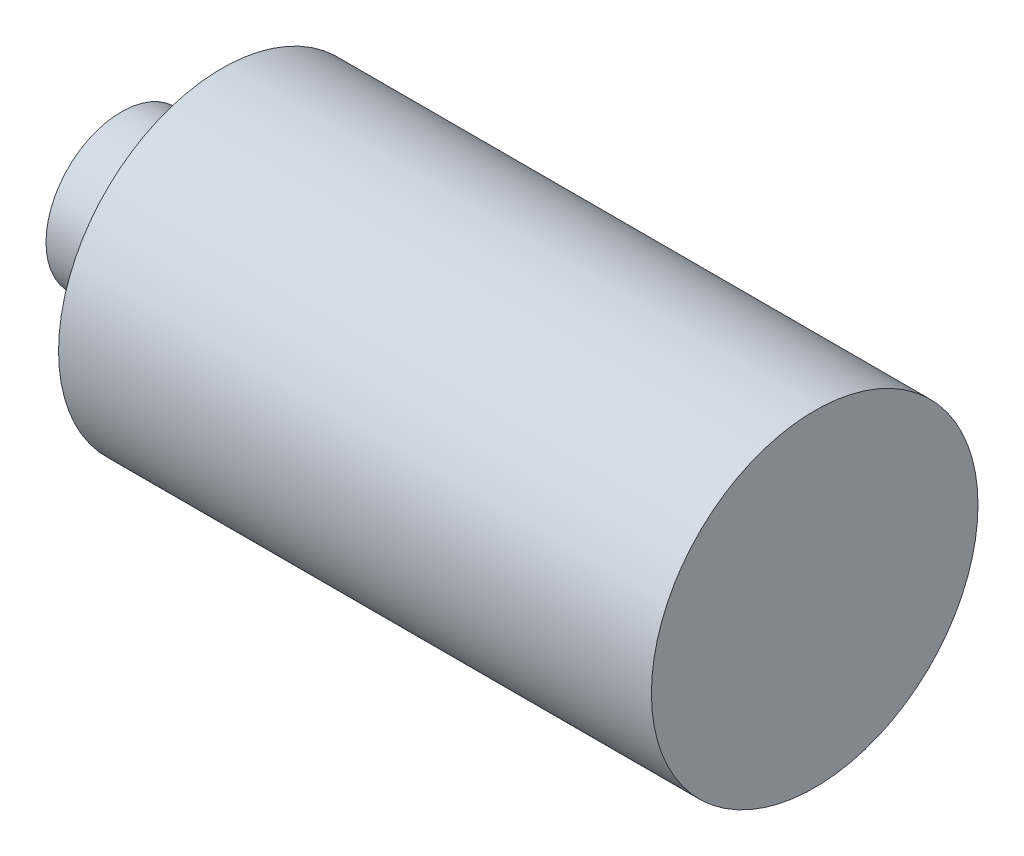
ISO-10303-21;
HEADER;
FILE_DESCRIPTION(('STEP AP214'),'2;1');
FILE_NAME('part.step','',(''),(''),'','','');
FILE_SCHEMA(('AUTOMOTIVE_DESIGN { 1 0 10303 214 1 1 1 1 }'));
ENDSEC;
DATA;
#1=APPLICATION_CONTEXT('core data for automotive mechanical design processes');
#2=APPLICATION_PROTOCOL_DEFINITION('international standard','automotive_design',2000,#1);
#3=PRODUCT_CONTEXT('',#1,'mechanical');
#4=PRODUCT('Part','Part','',(#3));
#5=PRODUCT_RELATED_PRODUCT_CATEGORY('part','',(#4));
#6=PRODUCT_DEFINITION_FORMATION('','',#4);
#7=PRODUCT_DEFINITION_CONTEXT('part definition',#1,'design');
#8=PRODUCT_DEFINITION('design','',#6,#7);
#9=PRODUCT_DEFINITION_SHAPE('','',#8);
#10=(LENGTH_UNIT() NAMED_UNIT(*) SI_UNIT(.MILLI.,.METRE.));
#11=(NAMED_UNIT(*) PLANE_ANGLE_UNIT() SI_UNIT($,.RADIAN.));
#12=(NAMED_UNIT(*) SI_UNIT($,.STERADIAN.) SOLID_ANGLE_UNIT());
#13=UNCERTAINTY_MEASURE_WITH_UNIT(LENGTH_MEASURE(1.E-05),#10,'distance_accuracy_value','');
#14=(GEOMETRIC_REPRESENTATION_CONTEXT(3) GLOBAL_UNCERTAINTY_ASSIGNED_CONTEXT((#13)) GLOBAL_UNIT_ASSIGNED_CONTEXT((#10,
#11,#12)) REPRESENTATION_CONTEXT('',''));
#15=CARTESIAN_POINT('',(0.,0.,0.));
#16=DIRECTION('',(0.,0.,1.));
#17=DIRECTION('',(1.,0.,0.));
#18=AXIS2_PLACEMENT_3D('',#15,#16,#17);
#19=CARTESIAN_POINT('',(11.8,0.,0.));
#20=DIRECTION('',(-1.,0.,0.));
#21=DIRECTION('',(0.,0.,1.));
#22=AXIS2_PLACEMENT_3D('',#19,#20,#21);
#23=PLANE('',#22);
#24=CARTESIAN_POINT('',(11.8,0.,0.));
#25=DIRECTION('',(-1.,0.,0.));
#26=DIRECTION('',(0.,0.,1.));
#27=AXIS2_PLACEMENT_3D('',#24,#25,#26);
#28=CIRCLE('',#27,3.25);
#29=CARTESIAN_POINT('',(11.8,0.,3.25));
#30=VERTEX_POINT('',#29);
#31=EDGE_CURVE('E10',#30,#30,#28,.T.);
#32=ORIENTED_EDGE('',*,*,#31,.F.);
#33=EDGE_LOOP('',(#32));
#34=FACE_BOUND('',#33,.T.);
#35=ADVANCED_FACE('F32',(#34),#23,.F.);
#36=CARTESIAN_POINT('',(-14.1304347826087,0.,0.));
#37=DIRECTION('',(-1.,0.,0.));
#38=DIRECTION('',(0.,0.,1.));
#39=AXIS2_PLACEMENT_3D('',#36,#37,#38);
#40=CYLINDRICAL_SURFACE('',#39,3.25);
#41=CARTESIAN_POINT('',(0.,0.,0.));
#42=DIRECTION('',(-1.,0.,0.));
#43=DIRECTION('',(0.,0.,1.));
#44=AXIS2_PLACEMENT_3D('',#41,#42,#43);
#45=CIRCLE('',#44,3.25);
#46=CARTESIAN_POINT('',(0.,0.,3.25));
#47=VERTEX_POINT('',#46);
#48=EDGE_CURVE('E38',#47,#47,#45,.T.);
#49=ORIENTED_EDGE('',*,*,#48,.F.);
#50=EDGE_LOOP('',(#49));
#51=FACE_BOUND('',#50,.T.);
#52=ORIENTED_EDGE('',*,*,#31,.T.);
#53=EDGE_LOOP('',(#52));
#54=FACE_BOUND('',#53,.T.);
#55=ADVANCED_FACE('F62',(#51,#54),#40,.T.);
#56=CARTESIAN_POINT('',(0.,3.25,0.));
#57=DIRECTION('',(1.,0.,0.));
#58=DIRECTION('',(0.,0.,-1.));
#59=AXIS2_PLACEMENT_3D('',#56,#57,#58);
#60=PLANE('',#59);
#61=CARTESIAN_POINT('',(0.,0.,0.));
#62=DIRECTION('',(-1.,0.,0.));
#63=DIRECTION('',(0.,0.,1.));
#64=AXIS2_PLACEMENT_3D('',#61,#62,#63);
#65=CIRCLE('',#64,1.5);
#66=CARTESIAN_POINT('',(0.,0.,1.5));
#67=VERTEX_POINT('',#66);
#68=EDGE_CURVE('E42',#67,#67,#65,.T.);
#69=ORIENTED_EDGE('',*,*,#68,.F.);
#70=EDGE_LOOP('',(#69));
#71=FACE_BOUND('',#70,.T.);
#72=ORIENTED_EDGE('',*,*,#48,.T.);
#73=EDGE_LOOP('',(#72));
#74=FACE_BOUND('',#73,.T.);
#75=ADVANCED_FACE('F57',(#71,#74),#60,.F.);
#76=CARTESIAN_POINT('',(-14.1304347826087,0.,0.));
#77=DIRECTION('',(-1.,0.,0.));
#78=DIRECTION('',(0.,0.,1.));
#79=AXIS2_PLACEMENT_3D('',#76,#77,#78);
#80=CYLINDRICAL_SURFACE('',#79,1.5);
#81=CARTESIAN_POINT('',(-2.,0.,0.));
#82=DIRECTION('',(-1.,0.,0.));
#83=DIRECTION('',(0.,0.,1.));
#84=AXIS2_PLACEMENT_3D('',#81,#82,#83);
#85=CIRCLE('',#84,1.5);
#86=CARTESIAN_POINT('',(-2.,0.,1.5));
#87=VERTEX_POINT('',#86);
#88=EDGE_CURVE('E46',#87,#87,#85,.T.);
#89=ORIENTED_EDGE('',*,*,#88,.F.);
#90=EDGE_LOOP('',(#89));
#91=FACE_BOUND('',#90,.T.);
#92=ORIENTED_EDGE('',*,*,#68,.T.);
#93=EDGE_LOOP('',(#92));
#94=FACE_BOUND('',#93,.T.);
#95=ADVANCED_FACE('F54',(#91,#94),#80,.T.);
#96=CARTESIAN_POINT('',(-2.,1.5,0.));
#97=DIRECTION('',(1.,0.,0.));
#98=DIRECTION('',(0.,0.,-1.));
#99=AXIS2_PLACEMENT_3D('',#96,#97,#98);
#100=PLANE('',#99);
#101=ORIENTED_EDGE('',*,*,#88,.T.);
#102=EDGE_LOOP('',(#101));
#103=FACE_BOUND('',#102,.T.);
#104=ADVANCED_FACE('F52',(#103),#100,.F.);
#105=CLOSED_SHELL('',(#35,#55,#75,#95,#104));
#106=MANIFOLD_SOLID_BREP('B2',#105);
#107=ADVANCED_BREP_SHAPE_REPRESENTATION('',(#18,#106),#14);
#108=SHAPE_DEFINITION_REPRESENTATION(#9,#107);
ENDSEC;
END-ISO-10303-21;
